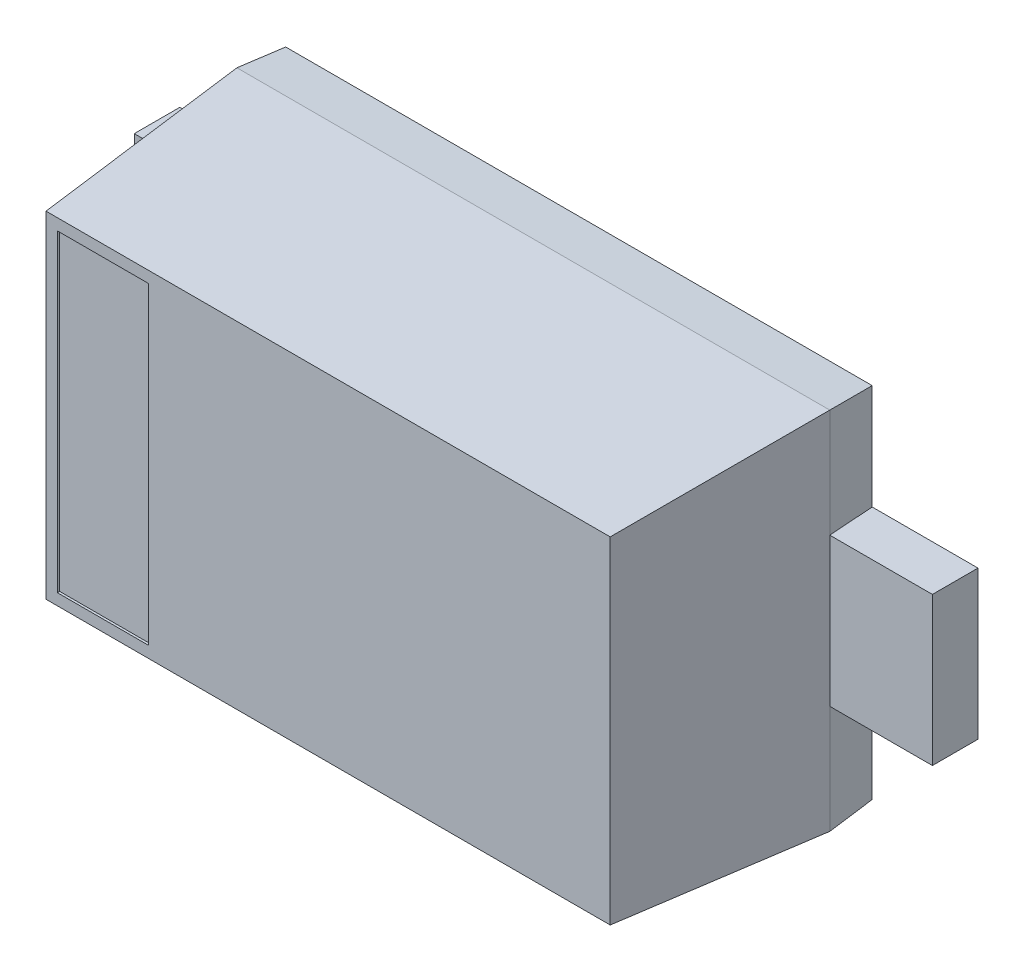
ISO-10303-21;
HEADER;
FILE_DESCRIPTION(('STEP AP214'),'2;1');
FILE_NAME('part.step','',(''),(''),'','','');
FILE_SCHEMA(('AUTOMOTIVE_DESIGN { 1 0 10303 214 1 1 1 1 }'));
ENDSEC;
DATA;
#1=APPLICATION_CONTEXT('core data for automotive mechanical design processes');
#2=APPLICATION_PROTOCOL_DEFINITION('international standard','automotive_design',2000,#1);
#3=PRODUCT_CONTEXT('',#1,'mechanical');
#4=PRODUCT('Part','Part','',(#3));
#5=PRODUCT_RELATED_PRODUCT_CATEGORY('part','',(#4));
#6=PRODUCT_DEFINITION_FORMATION('','',#4);
#7=PRODUCT_DEFINITION_CONTEXT('part definition',#1,'design');
#8=PRODUCT_DEFINITION('design','',#6,#7);
#9=PRODUCT_DEFINITION_SHAPE('','',#8);
#10=(LENGTH_UNIT() NAMED_UNIT(*) SI_UNIT(.MILLI.,.METRE.));
#11=(NAMED_UNIT(*) PLANE_ANGLE_UNIT() SI_UNIT($,.RADIAN.));
#12=(NAMED_UNIT(*) SI_UNIT($,.STERADIAN.) SOLID_ANGLE_UNIT());
#13=UNCERTAINTY_MEASURE_WITH_UNIT(LENGTH_MEASURE(1.E-05),#10,'distance_accuracy_value','');
#14=(GEOMETRIC_REPRESENTATION_CONTEXT(3) GLOBAL_UNCERTAINTY_ASSIGNED_CONTEXT((#13)) GLOBAL_UNIT_ASSIGNED_CONTEXT((#10,
#11,#12)) REPRESENTATION_CONTEXT('',''));
#15=CARTESIAN_POINT('',(0.,0.,0.));
#16=DIRECTION('',(0.,0.,1.));
#17=DIRECTION('',(1.,0.,0.));
#18=AXIS2_PLACEMENT_3D('',#15,#16,#17);
#19=CARTESIAN_POINT('',(-1.187065869251,-0.687065869251,1.09));
#20=DIRECTION('',(0.,0.,1.));
#21=DIRECTION('',(1.,0.,0.));
#22=AXIS2_PLACEMENT_3D('',#19,#20,#21);
#23=PLANE('',#22);
#24=DIRECTION('',(0.,1.,0.));
#25=VECTOR('',#24,1.);
#26=CARTESIAN_POINT('',(-1.187065869251,-0.687065869251,1.09));
#27=LINE('',#26,#25);
#28=CARTESIAN_POINT('',(-1.187065869251,-0.687065869251,1.09));
#29=VERTEX_POINT('',#28);
#30=CARTESIAN_POINT('',(-1.187065869251,0.687065869251,1.09));
#31=VERTEX_POINT('',#30);
#32=EDGE_CURVE('E122',#29,#31,#27,.T.);
#33=ORIENTED_EDGE('',*,*,#32,.F.);
#34=DIRECTION('',(1.,0.,0.));
#35=VECTOR('',#34,1.);
#36=CARTESIAN_POINT('',(-1.187065869251,-0.687065869251,1.09));
#37=LINE('',#36,#35);
#38=CARTESIAN_POINT('',(-0.787065869251,-0.687065869251,1.09));
#39=VERTEX_POINT('',#38);
#40=EDGE_CURVE('E126',#29,#39,#37,.T.);
#41=ORIENTED_EDGE('',*,*,#40,.T.);
#42=DIRECTION('',(0.,1.,0.));
#43=VECTOR('',#42,1.);
#44=CARTESIAN_POINT('',(-0.787065869251,-0.687065869251,1.09));
#45=LINE('',#44,#43);
#46=CARTESIAN_POINT('',(-0.787065869251,0.687065869251,1.09));
#47=VERTEX_POINT('',#46);
#48=EDGE_CURVE('E151',#39,#47,#45,.T.);
#49=ORIENTED_EDGE('',*,*,#48,.T.);
#50=DIRECTION('',(1.,0.,0.));
#51=VECTOR('',#50,1.);
#52=CARTESIAN_POINT('',(-1.187065869251,0.687065869251,1.09));
#53=LINE('',#52,#51);
#54=EDGE_CURVE('E128',#31,#47,#53,.T.);
#55=ORIENTED_EDGE('',*,*,#54,.F.);
#56=EDGE_LOOP('',(#33,#41,#49,#55));
#57=FACE_BOUND('',#56,.T.);
#58=ADVANCED_FACE('F17',(#57),#23,.T.);
#59=CARTESIAN_POINT('',(-1.286014637611,0.325,0.2));
#60=DIRECTION('',(0.,0.,1.));
#61=DIRECTION('',(1.,0.,0.));
#62=AXIS2_PLACEMENT_3D('',#59,#60,#61);
#63=PLANE('',#62);
#64=DIRECTION('',(0.,-1.,0.));
#65=VECTOR('',#64,1.);
#66=CARTESIAN_POINT('',(-1.3,0.8,0.2));
#67=LINE('',#66,#65);
#68=CARTESIAN_POINT('',(-1.3,0.325,0.2));
#69=VERTEX_POINT('',#68);
#70=CARTESIAN_POINT('',(-1.3,-0.325,0.2));
#71=VERTEX_POINT('',#70);
#72=EDGE_CURVE('E312',#69,#71,#67,.T.);
#73=ORIENTED_EDGE('',*,*,#72,.F.);
#74=DIRECTION('',(-1.,0.,0.));
#75=VECTOR('',#74,1.);
#76=CARTESIAN_POINT('',(-1.286014637611,0.325,0.2));
#77=LINE('',#76,#75);
#78=CARTESIAN_POINT('',(-1.75,0.325,0.2));
#79=VERTEX_POINT('',#78);
#80=EDGE_CURVE('E27',#69,#79,#77,.T.);
#81=ORIENTED_EDGE('',*,*,#80,.T.);
#82=DIRECTION('',(0.,-1.,0.));
#83=VECTOR('',#82,1.);
#84=CARTESIAN_POINT('',(-1.75,0.325,0.2));
#85=LINE('',#84,#83);
#86=CARTESIAN_POINT('',(-1.75,-0.325,0.2));
#87=VERTEX_POINT('',#86);
#88=EDGE_CURVE('E11',#79,#87,#85,.T.);
#89=ORIENTED_EDGE('',*,*,#88,.T.);
#90=DIRECTION('',(-1.,0.,0.));
#91=VECTOR('',#90,1.);
#92=CARTESIAN_POINT('',(-1.286014637611,-0.325,0.2));
#93=LINE('',#92,#91);
#94=EDGE_CURVE('E157',#71,#87,#93,.T.);
#95=ORIENTED_EDGE('',*,*,#94,.F.);
#96=EDGE_LOOP('',(#73,#81,#89,#95));
#97=FACE_BOUND('',#96,.T.);
#98=ADVANCED_FACE('F489',(#97),#63,.T.);
#99=CARTESIAN_POINT('',(-1.75,0.325,0.));
#100=DIRECTION('',(-1.,0.,0.));
#101=DIRECTION('',(0.,0.,1.));
#102=AXIS2_PLACEMENT_3D('',#99,#100,#101);
#103=PLANE('',#102);
#104=DIRECTION('',(0.,0.,1.));
#105=VECTOR('',#104,1.);
#106=CARTESIAN_POINT('',(-1.75,0.325,0.));
#107=LINE('',#106,#105);
#108=CARTESIAN_POINT('',(-1.75,0.325,0.));
#109=VERTEX_POINT('',#108);
#110=EDGE_CURVE('E166',#109,#79,#107,.T.);
#111=ORIENTED_EDGE('',*,*,#110,.F.);
#112=DIRECTION('',(0.,-1.,0.));
#113=VECTOR('',#112,1.);
#114=CARTESIAN_POINT('',(-1.75,0.325,0.));
#115=LINE('',#114,#113);
#116=CARTESIAN_POINT('',(-1.75,-0.325,0.));
#117=VERTEX_POINT('',#116);
#118=EDGE_CURVE('E266',#109,#117,#115,.T.);
#119=ORIENTED_EDGE('',*,*,#118,.T.);
#120=DIRECTION('',(0.,0.,1.));
#121=VECTOR('',#120,1.);
#122=CARTESIAN_POINT('',(-1.75,-0.325,0.));
#123=LINE('',#122,#121);
#124=EDGE_CURVE('E161',#117,#87,#123,.T.);
#125=ORIENTED_EDGE('',*,*,#124,.T.);
#126=ORIENTED_EDGE('',*,*,#88,.F.);
#127=EDGE_LOOP('',(#111,#119,#125,#126));
#128=FACE_BOUND('',#127,.T.);
#129=ADVANCED_FACE('F327',(#128),#103,.T.);
#130=CARTESIAN_POINT('',(-1.286014637611,0.325,0.));
#131=DIRECTION('',(0.,-1.,0.));
#132=DIRECTION('',(-1.,0.,0.));
#133=AXIS2_PLACEMENT_3D('',#130,#131,#132);
#134=PLANE('',#133);
#135=ORIENTED_EDGE('',*,*,#110,.T.);
#136=ORIENTED_EDGE('',*,*,#80,.F.);
#137=DIRECTION('',(-0.0697564737430673,0.,0.997564050259898));
#138=VECTOR('',#137,1.);
#139=CARTESIAN_POINT('',(-1.29300731708794,0.325,0.0999999754379));
#140=LINE('',#139,#138);
#141=CARTESIAN_POINT('',(-1.286014637611,0.325,0.));
#142=VERTEX_POINT('',#141);
#143=EDGE_CURVE('E169',#142,#69,#140,.T.);
#144=ORIENTED_EDGE('',*,*,#143,.F.);
#145=DIRECTION('',(-1.,0.,0.));
#146=VECTOR('',#145,1.);
#147=CARTESIAN_POINT('',(-1.286014637611,0.325,0.));
#148=LINE('',#147,#146);
#149=EDGE_CURVE('E174',#142,#109,#148,.T.);
#150=ORIENTED_EDGE('',*,*,#149,.T.);
#151=EDGE_LOOP('',(#135,#136,#144,#150));
#152=FACE_BOUND('',#151,.T.);
#153=ADVANCED_FACE('F322',(#152),#134,.F.);
#154=CARTESIAN_POINT('',(-1.286014637611,-0.325,0.));
#155=DIRECTION('',(0.,-1.,0.));
#156=DIRECTION('',(-1.,0.,0.));
#157=AXIS2_PLACEMENT_3D('',#154,#155,#156);
#158=PLANE('',#157);
#159=DIRECTION('',(-1.,0.,0.));
#160=VECTOR('',#159,1.);
#161=CARTESIAN_POINT('',(-1.286014637611,-0.325,0.));
#162=LINE('',#161,#160);
#163=CARTESIAN_POINT('',(-1.286014637611,-0.325,0.));
#164=VERTEX_POINT('',#163);
#165=EDGE_CURVE('E305',#164,#117,#162,.T.);
#166=ORIENTED_EDGE('',*,*,#165,.F.);
#167=DIRECTION('',(-0.0697564737430673,0.,0.997564050259898));
#168=VECTOR('',#167,1.);
#169=CARTESIAN_POINT('',(-1.29300731708794,-0.325,0.0999999754379));
#170=LINE('',#169,#168);
#171=EDGE_CURVE('E175',#164,#71,#170,.T.);
#172=ORIENTED_EDGE('',*,*,#171,.T.);
#173=ORIENTED_EDGE('',*,*,#94,.T.);
#174=ORIENTED_EDGE('',*,*,#124,.F.);
#175=EDGE_LOOP('',(#166,#172,#173,#174));
#176=FACE_BOUND('',#175,.T.);
#177=ADVANCED_FACE('F334',(#176),#158,.T.);
#178=CARTESIAN_POINT('',(-1.187065869251,0.687065869251,1.09));
#179=DIRECTION('',(0.,1.,0.));
#180=DIRECTION('',(1.,0.,0.));
#181=AXIS2_PLACEMENT_3D('',#178,#179,#180);
#182=PLANE('',#181);
#183=DIRECTION('',(1.,0.,0.));
#184=VECTOR('',#183,1.);
#185=CARTESIAN_POINT('',(-1.212065869251,0.687065869251,1.1));
#186=LINE('',#185,#184);
#187=CARTESIAN_POINT('',(-1.187065869251,0.687065869251,1.1));
#188=VERTEX_POINT('',#187);
#189=CARTESIAN_POINT('',(-0.787065869251,0.687065869251,1.1));
#190=VERTEX_POINT('',#189);
#191=EDGE_CURVE('E252',#188,#190,#186,.T.);
#192=ORIENTED_EDGE('',*,*,#191,.F.);
#193=DIRECTION('',(0.,0.,1.));
#194=VECTOR('',#193,1.);
#195=CARTESIAN_POINT('',(-1.187065869251,0.687065869251,1.09));
#196=LINE('',#195,#194);
#197=EDGE_CURVE('E132',#31,#188,#196,.T.);
#198=ORIENTED_EDGE('',*,*,#197,.F.);
#199=ORIENTED_EDGE('',*,*,#54,.T.);
#200=DIRECTION('',(0.,0.,1.));
#201=VECTOR('',#200,1.);
#202=CARTESIAN_POINT('',(-0.787065869251,0.687065869251,1.09));
#203=LINE('',#202,#201);
#204=EDGE_CURVE('E316',#47,#190,#203,.T.);
#205=ORIENTED_EDGE('',*,*,#204,.T.);
#206=EDGE_LOOP('',(#192,#198,#199,#205));
#207=FACE_BOUND('',#206,.T.);
#208=ADVANCED_FACE('F426',(#207),#182,.F.);
#209=CARTESIAN_POINT('',(-1.187065869251,-0.687065869251,1.09));
#210=DIRECTION('',(1.,0.,0.));
#211=DIRECTION('',(0.,1.,0.));
#212=AXIS2_PLACEMENT_3D('',#209,#210,#211);
#213=PLANE('',#212);
#214=DIRECTION('',(0.,0.,1.));
#215=VECTOR('',#214,1.);
#216=CARTESIAN_POINT('',(-1.187065869251,-0.687065869251,1.09));
#217=LINE('',#216,#215);
#218=CARTESIAN_POINT('',(-1.187065869251,-0.687065869251,1.1));
#219=VERTEX_POINT('',#218);
#220=EDGE_CURVE('E133',#29,#219,#217,.T.);
#221=ORIENTED_EDGE('',*,*,#220,.F.);
#222=ORIENTED_EDGE('',*,*,#32,.T.);
#223=ORIENTED_EDGE('',*,*,#197,.T.);
#224=DIRECTION('',(0.,-1.,0.));
#225=VECTOR('',#224,1.);
#226=CARTESIAN_POINT('',(-1.187065869251,-0.712065869251,1.1));
#227=LINE('',#226,#225);
#228=EDGE_CURVE('E138',#188,#219,#227,.T.);
#229=ORIENTED_EDGE('',*,*,#228,.T.);
#230=EDGE_LOOP('',(#221,#222,#223,#229));
#231=FACE_BOUND('',#230,.T.);
#232=ADVANCED_FACE('F136',(#231),#213,.T.);
#233=CARTESIAN_POINT('',(-1.187065869251,-0.687065869251,1.09));
#234=DIRECTION('',(0.,1.,0.));
#235=DIRECTION('',(1.,0.,0.));
#236=AXIS2_PLACEMENT_3D('',#233,#234,#235);
#237=PLANE('',#236);
#238=DIRECTION('',(0.,0.,1.));
#239=VECTOR('',#238,1.);
#240=CARTESIAN_POINT('',(-0.787065869251,-0.687065869251,1.09));
#241=LINE('',#240,#239);
#242=CARTESIAN_POINT('',(-0.787065869251,-0.687065869251,1.1));
#243=VERTEX_POINT('',#242);
#244=EDGE_CURVE('E145',#39,#243,#241,.T.);
#245=ORIENTED_EDGE('',*,*,#244,.F.);
#246=ORIENTED_EDGE('',*,*,#40,.F.);
#247=ORIENTED_EDGE('',*,*,#220,.T.);
#248=DIRECTION('',(1.,0.,0.));
#249=VECTOR('',#248,1.);
#250=CARTESIAN_POINT('',(-1.212065869251,-0.687065869251,1.1));
#251=LINE('',#250,#249);
#252=EDGE_CURVE('E300',#219,#243,#251,.T.);
#253=ORIENTED_EDGE('',*,*,#252,.T.);
#254=EDGE_LOOP('',(#245,#246,#247,#253));
#255=FACE_BOUND('',#254,.T.);
#256=ADVANCED_FACE('F144',(#255),#237,.T.);
#257=CARTESIAN_POINT('',(-0.787065869251,-0.687065869251,1.09));
#258=DIRECTION('',(1.,0.,0.));
#259=DIRECTION('',(0.,1.,0.));
#260=AXIS2_PLACEMENT_3D('',#257,#258,#259);
#261=PLANE('',#260);
#262=DIRECTION('',(0.,-1.,0.));
#263=VECTOR('',#262,1.);
#264=CARTESIAN_POINT('',(-0.787065869251,-0.712065869251,1.1));
#265=LINE('',#264,#263);
#266=EDGE_CURVE('E249',#190,#243,#265,.T.);
#267=ORIENTED_EDGE('',*,*,#266,.F.);
#268=ORIENTED_EDGE('',*,*,#204,.F.);
#269=ORIENTED_EDGE('',*,*,#48,.F.);
#270=ORIENTED_EDGE('',*,*,#244,.T.);
#271=EDGE_LOOP('',(#267,#268,#269,#270));
#272=FACE_BOUND('',#271,.T.);
#273=ADVANCED_FACE('F423',(#272),#261,.F.);
#274=CARTESIAN_POINT('',(-1.3,0.8,0.2));
#275=DIRECTION('',(-0.997564050259837,0.,0.0697564737439494));
#276=DIRECTION('',(0.,-1.,0.));
#277=AXIS2_PLACEMENT_3D('',#274,#275,#276);
#278=PLANE('',#277);
#279=DIRECTION('',(0.,-1.,0.));
#280=VECTOR('',#279,1.);
#281=CARTESIAN_POINT('',(-1.3,0.8,0.2));
#282=LINE('',#281,#280);
#283=CARTESIAN_POINT('',(-1.3,0.8,0.2));
#284=VERTEX_POINT('',#283);
#285=EDGE_CURVE('E173',#284,#69,#282,.T.);
#286=ORIENTED_EDGE('',*,*,#285,.T.);
#287=ORIENTED_EDGE('',*,*,#72,.T.);
#288=DIRECTION('',(0.,-1.,0.));
#289=VECTOR('',#288,1.);
#290=CARTESIAN_POINT('',(-1.3,0.8,0.2));
#291=LINE('',#290,#289);
#292=CARTESIAN_POINT('',(-1.3,-0.8,0.2));
#293=VERTEX_POINT('',#292);
#294=EDGE_CURVE('E179',#71,#293,#291,.T.);
#295=ORIENTED_EDGE('',*,*,#294,.T.);
#296=DIRECTION('',(0.06958737431649,0.0695873743164903,0.995145815783533));
#297=VECTOR('',#296,1.);
#298=CARTESIAN_POINT('',(-1.2685329346255,-0.7685329346255,0.65));
#299=LINE('',#298,#297);
#300=CARTESIAN_POINT('',(-1.237065869251,-0.737065869251,1.1));
#301=VERTEX_POINT('',#300);
#302=EDGE_CURVE('E189',#293,#301,#299,.T.);
#303=ORIENTED_EDGE('',*,*,#302,.T.);
#304=DIRECTION('',(0.,-1.,0.));
#305=VECTOR('',#304,1.);
#306=CARTESIAN_POINT('',(-1.237065869251,0.737065869251,1.1));
#307=LINE('',#306,#305);
#308=CARTESIAN_POINT('',(-1.237065869251,0.737065869251,1.1));
#309=VERTEX_POINT('',#308);
#310=EDGE_CURVE('E297',#309,#301,#307,.T.);
#311=ORIENTED_EDGE('',*,*,#310,.F.);
#312=DIRECTION('',(0.06958737431649,-0.0695873743164903,0.995145815783533));
#313=VECTOR('',#312,1.);
#314=CARTESIAN_POINT('',(-1.2685329346255,0.7685329346255,0.65));
#315=LINE('',#314,#313);
#316=EDGE_CURVE('E184',#284,#309,#315,.T.);
#317=ORIENTED_EDGE('',*,*,#316,.F.);
#318=EDGE_LOOP('',(#286,#287,#295,#303,#311,#317));
#319=FACE_BOUND('',#318,.T.);
#320=ADVANCED_FACE('F342',(#319),#278,.T.);
#321=CARTESIAN_POINT('',(-1.286014637611,0.786014637611,0.));
#322=DIRECTION('',(-0.997564050259721,0.,-0.0697564737456034));
#323=DIRECTION('',(0.,-1.,0.));
#324=AXIS2_PLACEMENT_3D('',#321,#322,#323);
#325=PLANE('',#324);
#326=DIRECTION('',(-0.0695873743181321,0.0695873743181331,0.995145815783303));
#327=VECTOR('',#326,1.);
#328=CARTESIAN_POINT('',(-1.2930073188055,0.7930073188055,0.1));
#329=LINE('',#328,#327);
#330=CARTESIAN_POINT('',(-1.286014637611,0.786014637611,0.));
#331=VERTEX_POINT('',#330);
#332=EDGE_CURVE('E180',#331,#284,#329,.T.);
#333=ORIENTED_EDGE('',*,*,#332,.F.);
#334=DIRECTION('',(0.,-1.,0.));
#335=VECTOR('',#334,1.);
#336=CARTESIAN_POINT('',(-1.286014637611,0.786014637611,0.));
#337=LINE('',#336,#335);
#338=EDGE_CURVE('E283',#331,#142,#337,.T.);
#339=ORIENTED_EDGE('',*,*,#338,.T.);
#340=ORIENTED_EDGE('',*,*,#143,.T.);
#341=ORIENTED_EDGE('',*,*,#285,.F.);
#342=EDGE_LOOP('',(#333,#339,#340,#341));
#343=FACE_BOUND('',#342,.T.);
#344=ADVANCED_FACE('F452',(#343),#325,.T.);
#345=CARTESIAN_POINT('',(-1.286014637611,0.786014637611,0.));
#346=DIRECTION('',(-0.997564050259721,0.,-0.0697564737456034));
#347=DIRECTION('',(0.,-1.,0.));
#348=AXIS2_PLACEMENT_3D('',#345,#346,#347);
#349=PLANE('',#348);
#350=ORIENTED_EDGE('',*,*,#171,.F.);
#351=DIRECTION('',(0.,-1.,0.));
#352=VECTOR('',#351,1.);
#353=CARTESIAN_POINT('',(-1.286014637611,0.786014637611,0.));
#354=LINE('',#353,#352);
#355=CARTESIAN_POINT('',(-1.286014637611,-0.786014637611,0.));
#356=VERTEX_POINT('',#355);
#357=EDGE_CURVE('E276',#164,#356,#354,.T.);
#358=ORIENTED_EDGE('',*,*,#357,.T.);
#359=DIRECTION('',(-0.0695873743181321,-0.0695873743181331,0.995145815783303));
#360=VECTOR('',#359,1.);
#361=CARTESIAN_POINT('',(-1.2930073188055,-0.7930073188055,0.1));
#362=LINE('',#361,#360);
#363=EDGE_CURVE('E195',#356,#293,#362,.T.);
#364=ORIENTED_EDGE('',*,*,#363,.T.);
#365=ORIENTED_EDGE('',*,*,#294,.F.);
#366=EDGE_LOOP('',(#350,#358,#364,#365));
#367=FACE_BOUND('',#366,.T.);
#368=ADVANCED_FACE('F337',(#367),#349,.T.);
#369=CARTESIAN_POINT('',(1.286014637611,0.786014637611,0.));
#370=DIRECTION('',(0.,0.997564050259721,-0.0697564737456045));
#371=DIRECTION('',(-1.,0.,0.));
#372=AXIS2_PLACEMENT_3D('',#369,#370,#371);
#373=PLANE('',#372);
#374=DIRECTION('',(-1.,0.,0.));
#375=VECTOR('',#374,1.);
#376=CARTESIAN_POINT('',(1.286014637611,0.786014637611,0.));
#377=LINE('',#376,#375);
#378=CARTESIAN_POINT('',(1.286014637611,0.786014637611,0.));
#379=VERTEX_POINT('',#378);
#380=EDGE_CURVE('E287',#379,#331,#377,.T.);
#381=ORIENTED_EDGE('',*,*,#380,.T.);
#382=ORIENTED_EDGE('',*,*,#332,.T.);
#383=DIRECTION('',(-1.,0.,0.));
#384=VECTOR('',#383,1.);
#385=CARTESIAN_POINT('',(1.3,0.8,0.2));
#386=LINE('',#385,#384);
#387=CARTESIAN_POINT('',(1.3,0.8,0.2));
#388=VERTEX_POINT('',#387);
#389=EDGE_CURVE('E188',#388,#284,#386,.T.);
#390=ORIENTED_EDGE('',*,*,#389,.F.);
#391=DIRECTION('',(0.0695873743181321,0.0695873743181331,0.995145815783303));
#392=VECTOR('',#391,1.);
#393=CARTESIAN_POINT('',(1.2930073188055,0.7930073188055,0.1));
#394=LINE('',#393,#392);
#395=EDGE_CURVE('E200',#379,#388,#394,.T.);
#396=ORIENTED_EDGE('',*,*,#395,.F.);
#397=EDGE_LOOP('',(#381,#382,#390,#396));
#398=FACE_BOUND('',#397,.T.);
#399=ADVANCED_FACE('F446',(#398),#373,.T.);
#400=CARTESIAN_POINT('',(1.3,0.8,0.2));
#401=DIRECTION('',(0.,0.997564050259837,0.0697564737439496));
#402=DIRECTION('',(-1.,0.,0.));
#403=AXIS2_PLACEMENT_3D('',#400,#401,#402);
#404=PLANE('',#403);
#405=ORIENTED_EDGE('',*,*,#389,.T.);
#406=ORIENTED_EDGE('',*,*,#316,.T.);
#407=DIRECTION('',(-1.,0.,0.));
#408=VECTOR('',#407,1.);
#409=CARTESIAN_POINT('',(1.237065869251,0.737065869251,1.1));
#410=LINE('',#409,#408);
#411=CARTESIAN_POINT('',(1.237065869251,0.737065869251,1.1));
#412=VERTEX_POINT('',#411);
#413=EDGE_CURVE('E193',#412,#309,#410,.T.);
#414=ORIENTED_EDGE('',*,*,#413,.F.);
#415=DIRECTION('',(-0.06958737431649,-0.0695873743164903,0.995145815783533));
#416=VECTOR('',#415,1.);
#417=CARTESIAN_POINT('',(1.2685329346255,0.7685329346255,0.65));
#418=LINE('',#417,#416);
#419=EDGE_CURVE('E211',#388,#412,#418,.T.);
#420=ORIENTED_EDGE('',*,*,#419,.F.);
#421=EDGE_LOOP('',(#405,#406,#414,#420));
#422=FACE_BOUND('',#421,.T.);
#423=ADVANCED_FACE('F442',(#422),#404,.T.);
#424=CARTESIAN_POINT('',(-1.237065869251,-0.737065869251,1.1));
#425=DIRECTION('',(0.,0.,-1.));
#426=DIRECTION('',(0.,-1.,0.));
#427=AXIS2_PLACEMENT_3D('',#424,#425,#426);
#428=PLANE('',#427);
#429=ORIENTED_EDGE('',*,*,#252,.F.);
#430=ORIENTED_EDGE('',*,*,#228,.F.);
#431=ORIENTED_EDGE('',*,*,#191,.T.);
#432=ORIENTED_EDGE('',*,*,#266,.T.);
#433=EDGE_LOOP('',(#429,#430,#431,#432));
#434=FACE_BOUND('',#433,.T.);
#435=DIRECTION('',(0.,1.,0.));
#436=VECTOR('',#435,1.);
#437=CARTESIAN_POINT('',(1.237065869251,-0.737065869251,1.1));
#438=LINE('',#437,#436);
#439=CARTESIAN_POINT('',(1.237065869251,-0.737065869251,1.1));
#440=VERTEX_POINT('',#439);
#441=EDGE_CURVE('E210',#440,#412,#438,.T.);
#442=ORIENTED_EDGE('',*,*,#441,.T.);
#443=ORIENTED_EDGE('',*,*,#413,.T.);
#444=ORIENTED_EDGE('',*,*,#310,.T.);
#445=DIRECTION('',(1.,0.,0.));
#446=VECTOR('',#445,1.);
#447=CARTESIAN_POINT('',(-1.237065869251,-0.737065869251,1.1));
#448=LINE('',#447,#446);
#449=EDGE_CURVE('E194',#301,#440,#448,.T.);
#450=ORIENTED_EDGE('',*,*,#449,.T.);
#451=EDGE_LOOP('',(#442,#443,#444,#450));
#452=FACE_BOUND('',#451,.T.);
#453=ADVANCED_FACE('F353',(#434,#452),#428,.F.);
#454=CARTESIAN_POINT('',(-1.3,-0.8,0.2));
#455=DIRECTION('',(0.,-0.997564050259837,0.0697564737439496));
#456=DIRECTION('',(1.,0.,0.));
#457=AXIS2_PLACEMENT_3D('',#454,#455,#456);
#458=PLANE('',#457);
#459=DIRECTION('',(1.,0.,0.));
#460=VECTOR('',#459,1.);
#461=CARTESIAN_POINT('',(-1.3,-0.8,0.2));
#462=LINE('',#461,#460);
#463=CARTESIAN_POINT('',(1.3,-0.8,0.2));
#464=VERTEX_POINT('',#463);
#465=EDGE_CURVE('E199',#293,#464,#462,.T.);
#466=ORIENTED_EDGE('',*,*,#465,.T.);
#467=DIRECTION('',(-0.06958737431649,0.0695873743164903,0.995145815783533));
#468=VECTOR('',#467,1.);
#469=CARTESIAN_POINT('',(1.2685329346255,-0.7685329346255,0.65));
#470=LINE('',#469,#468);
#471=EDGE_CURVE('E206',#464,#440,#470,.T.);
#472=ORIENTED_EDGE('',*,*,#471,.T.);
#473=ORIENTED_EDGE('',*,*,#449,.F.);
#474=ORIENTED_EDGE('',*,*,#302,.F.);
#475=EDGE_LOOP('',(#466,#472,#473,#474));
#476=FACE_BOUND('',#475,.T.);
#477=ADVANCED_FACE('F347',(#476),#458,.T.);
#478=CARTESIAN_POINT('',(-1.286014637611,-0.786014637611,0.));
#479=DIRECTION('',(0.,-0.997564050259721,-0.0697564737456045));
#480=DIRECTION('',(1.,0.,0.));
#481=AXIS2_PLACEMENT_3D('',#478,#479,#480);
#482=PLANE('',#481);
#483=DIRECTION('',(1.,0.,0.));
#484=VECTOR('',#483,1.);
#485=CARTESIAN_POINT('',(-1.286014637611,-0.786014637611,0.));
#486=LINE('',#485,#484);
#487=CARTESIAN_POINT('',(1.286014637611,-0.786014637611,0.));
#488=VERTEX_POINT('',#487);
#489=EDGE_CURVE('E204',#356,#488,#486,.T.);
#490=ORIENTED_EDGE('',*,*,#489,.T.);
#491=DIRECTION('',(0.0695873743181321,-0.0695873743181331,0.995145815783303));
#492=VECTOR('',#491,1.);
#493=CARTESIAN_POINT('',(1.2930073188055,-0.7930073188055,0.1));
#494=LINE('',#493,#492);
#495=EDGE_CURVE('E216',#488,#464,#494,.T.);
#496=ORIENTED_EDGE('',*,*,#495,.T.);
#497=ORIENTED_EDGE('',*,*,#465,.F.);
#498=ORIENTED_EDGE('',*,*,#363,.F.);
#499=EDGE_LOOP('',(#490,#496,#497,#498));
#500=FACE_BOUND('',#499,.T.);
#501=ADVANCED_FACE('F380',(#500),#482,.T.);
#502=CARTESIAN_POINT('',(1.286014637611,-0.786014637611,0.));
#503=DIRECTION('',(0.997564050259721,0.,-0.0697564737456034));
#504=DIRECTION('',(0.,1.,0.));
#505=AXIS2_PLACEMENT_3D('',#502,#503,#504);
#506=PLANE('',#505);
#507=DIRECTION('',(0.0697564737430673,0.,0.997564050259898));
#508=VECTOR('',#507,1.);
#509=CARTESIAN_POINT('',(1.29300731708794,0.325,0.0999999754379));
#510=LINE('',#509,#508);
#511=CARTESIAN_POINT('',(1.286014637611,0.325,0.));
#512=VERTEX_POINT('',#511);
#513=CARTESIAN_POINT('',(1.3,0.325,0.2));
#514=VERTEX_POINT('',#513);
#515=EDGE_CURVE('E220',#512,#514,#510,.T.);
#516=ORIENTED_EDGE('',*,*,#515,.F.);
#517=DIRECTION('',(0.,1.,0.));
#518=VECTOR('',#517,1.);
#519=CARTESIAN_POINT('',(1.286014637611,-0.786014637611,0.));
#520=LINE('',#519,#518);
#521=EDGE_CURVE('E205',#512,#379,#520,.T.);
#522=ORIENTED_EDGE('',*,*,#521,.T.);
#523=ORIENTED_EDGE('',*,*,#395,.T.);
#524=DIRECTION('',(0.,1.,0.));
#525=VECTOR('',#524,1.);
#526=CARTESIAN_POINT('',(1.3,-0.8,0.2));
#527=LINE('',#526,#525);
#528=EDGE_CURVE('E215',#514,#388,#527,.T.);
#529=ORIENTED_EDGE('',*,*,#528,.F.);
#530=EDGE_LOOP('',(#516,#522,#523,#529));
#531=FACE_BOUND('',#530,.T.);
#532=ADVANCED_FACE('F449',(#531),#506,.T.);
#533=CARTESIAN_POINT('',(1.3,-0.8,0.2));
#534=DIRECTION('',(0.997564050259837,0.,0.0697564737439494));
#535=DIRECTION('',(0.,1.,0.));
#536=AXIS2_PLACEMENT_3D('',#533,#534,#535);
#537=PLANE('',#536);
#538=DIRECTION('',(0.,1.,0.));
#539=VECTOR('',#538,1.);
#540=CARTESIAN_POINT('',(1.3,-0.8,0.2));
#541=LINE('',#540,#539);
#542=CARTESIAN_POINT('',(1.3,-0.325,0.2));
#543=VERTEX_POINT('',#542);
#544=EDGE_CURVE('E256',#464,#543,#541,.T.);
#545=ORIENTED_EDGE('',*,*,#544,.T.);
#546=DIRECTION('',(0.,1.,0.));
#547=VECTOR('',#546,1.);
#548=CARTESIAN_POINT('',(1.3,-0.8,0.2));
#549=LINE('',#548,#547);
#550=EDGE_CURVE('E244',#543,#514,#549,.T.);
#551=ORIENTED_EDGE('',*,*,#550,.T.);
#552=ORIENTED_EDGE('',*,*,#528,.T.);
#553=ORIENTED_EDGE('',*,*,#419,.T.);
#554=ORIENTED_EDGE('',*,*,#441,.F.);
#555=ORIENTED_EDGE('',*,*,#471,.F.);
#556=EDGE_LOOP('',(#545,#551,#552,#553,#554,#555));
#557=FACE_BOUND('',#556,.T.);
#558=ADVANCED_FACE('F512',(#557),#537,.T.);
#559=CARTESIAN_POINT('',(1.286014637611,-0.786014637611,0.));
#560=DIRECTION('',(0.997564050259721,0.,-0.0697564737456034));
#561=DIRECTION('',(0.,1.,0.));
#562=AXIS2_PLACEMENT_3D('',#559,#560,#561);
#563=PLANE('',#562);
#564=ORIENTED_EDGE('',*,*,#495,.F.);
#565=DIRECTION('',(0.,1.,0.));
#566=VECTOR('',#565,1.);
#567=CARTESIAN_POINT('',(1.286014637611,-0.786014637611,0.));
#568=LINE('',#567,#566);
#569=CARTESIAN_POINT('',(1.286014637611,-0.325,0.));
#570=VERTEX_POINT('',#569);
#571=EDGE_CURVE('E219',#488,#570,#568,.T.);
#572=ORIENTED_EDGE('',*,*,#571,.T.);
#573=DIRECTION('',(0.0697564737430673,0.,0.997564050259898));
#574=VECTOR('',#573,1.);
#575=CARTESIAN_POINT('',(1.29300731708794,-0.325,0.0999999754379));
#576=LINE('',#575,#574);
#577=EDGE_CURVE('E21',#570,#543,#576,.T.);
#578=ORIENTED_EDGE('',*,*,#577,.T.);
#579=ORIENTED_EDGE('',*,*,#544,.F.);
#580=EDGE_LOOP('',(#564,#572,#578,#579));
#581=FACE_BOUND('',#580,.T.);
#582=ADVANCED_FACE('F19',(#581),#563,.T.);
#583=CARTESIAN_POINT('',(1.286014637611,-0.325,0.));
#584=DIRECTION('',(0.,0.,1.));
#585=DIRECTION('',(1.,0.,0.));
#586=AXIS2_PLACEMENT_3D('',#583,#584,#585);
#587=PLANE('',#586);
#588=DIRECTION('',(1.,0.,0.));
#589=VECTOR('',#588,1.);
#590=CARTESIAN_POINT('',(1.286014637611,0.325,0.));
#591=LINE('',#590,#589);
#592=CARTESIAN_POINT('',(1.75,0.325,0.));
#593=VERTEX_POINT('',#592);
#594=EDGE_CURVE('E223',#512,#593,#591,.T.);
#595=ORIENTED_EDGE('',*,*,#594,.T.);
#596=DIRECTION('',(0.,1.,0.));
#597=VECTOR('',#596,1.);
#598=CARTESIAN_POINT('',(1.75,-0.325,0.));
#599=LINE('',#598,#597);
#600=CARTESIAN_POINT('',(1.75,-0.325,0.));
#601=VERTEX_POINT('',#600);
#602=EDGE_CURVE('E410',#601,#593,#599,.T.);
#603=ORIENTED_EDGE('',*,*,#602,.F.);
#604=DIRECTION('',(1.,0.,0.));
#605=VECTOR('',#604,1.);
#606=CARTESIAN_POINT('',(1.286014637611,-0.325,0.));
#607=LINE('',#606,#605);
#608=EDGE_CURVE('E403',#570,#601,#607,.T.);
#609=ORIENTED_EDGE('',*,*,#608,.F.);
#610=ORIENTED_EDGE('',*,*,#571,.F.);
#611=ORIENTED_EDGE('',*,*,#489,.F.);
#612=ORIENTED_EDGE('',*,*,#357,.F.);
#613=ORIENTED_EDGE('',*,*,#165,.T.);
#614=ORIENTED_EDGE('',*,*,#118,.F.);
#615=ORIENTED_EDGE('',*,*,#149,.F.);
#616=ORIENTED_EDGE('',*,*,#338,.F.);
#617=ORIENTED_EDGE('',*,*,#380,.F.);
#618=ORIENTED_EDGE('',*,*,#521,.F.);
#619=EDGE_LOOP('',(#595,#603,#609,#610,#611,#612,#613,#614,#615,#616,#617,#618));
#620=FACE_BOUND('',#619,.T.);
#621=ADVANCED_FACE('F330',(#620),#587,.F.);
#622=CARTESIAN_POINT('',(1.286014637611,0.325,0.));
#623=DIRECTION('',(0.,1.,0.));
#624=DIRECTION('',(1.,0.,0.));
#625=AXIS2_PLACEMENT_3D('',#622,#623,#624);
#626=PLANE('',#625);
#627=ORIENTED_EDGE('',*,*,#594,.F.);
#628=ORIENTED_EDGE('',*,*,#515,.T.);
#629=DIRECTION('',(1.,0.,0.));
#630=VECTOR('',#629,1.);
#631=CARTESIAN_POINT('',(1.286014637611,0.325,0.2));
#632=LINE('',#631,#630);
#633=CARTESIAN_POINT('',(1.75,0.325,0.2));
#634=VERTEX_POINT('',#633);
#635=EDGE_CURVE('E234',#514,#634,#632,.T.);
#636=ORIENTED_EDGE('',*,*,#635,.T.);
#637=DIRECTION('',(0.,0.,1.));
#638=VECTOR('',#637,1.);
#639=CARTESIAN_POINT('',(1.75,0.325,0.));
#640=LINE('',#639,#638);
#641=EDGE_CURVE('E404',#593,#634,#640,.T.);
#642=ORIENTED_EDGE('',*,*,#641,.F.);
#643=EDGE_LOOP('',(#627,#628,#636,#642));
#644=FACE_BOUND('',#643,.T.);
#645=ADVANCED_FACE('F528',(#644),#626,.T.);
#646=CARTESIAN_POINT('',(1.286014637611,-0.325,0.2));
#647=DIRECTION('',(0.,0.,1.));
#648=DIRECTION('',(1.,0.,0.));
#649=AXIS2_PLACEMENT_3D('',#646,#647,#648);
#650=PLANE('',#649);
#651=ORIENTED_EDGE('',*,*,#550,.F.);
#652=DIRECTION('',(1.,0.,0.));
#653=VECTOR('',#652,1.);
#654=CARTESIAN_POINT('',(1.286014637611,-0.325,0.2));
#655=LINE('',#654,#653);
#656=CARTESIAN_POINT('',(1.75,-0.325,0.2));
#657=VERTEX_POINT('',#656);
#658=EDGE_CURVE('E391',#543,#657,#655,.T.);
#659=ORIENTED_EDGE('',*,*,#658,.T.);
#660=DIRECTION('',(0.,1.,0.));
#661=VECTOR('',#660,1.);
#662=CARTESIAN_POINT('',(1.75,-0.325,0.2));
#663=LINE('',#662,#661);
#664=EDGE_CURVE('E388',#657,#634,#663,.T.);
#665=ORIENTED_EDGE('',*,*,#664,.T.);
#666=ORIENTED_EDGE('',*,*,#635,.F.);
#667=EDGE_LOOP('',(#651,#659,#665,#666));
#668=FACE_BOUND('',#667,.T.);
#669=ADVANCED_FACE('F486',(#668),#650,.T.);
#670=CARTESIAN_POINT('',(1.286014637611,-0.325,0.));
#671=DIRECTION('',(0.,1.,0.));
#672=DIRECTION('',(1.,0.,0.));
#673=AXIS2_PLACEMENT_3D('',#670,#671,#672);
#674=PLANE('',#673);
#675=DIRECTION('',(0.,0.,1.));
#676=VECTOR('',#675,1.);
#677=CARTESIAN_POINT('',(1.75,-0.325,0.));
#678=LINE('',#677,#676);
#679=EDGE_CURVE('E416',#601,#657,#678,.T.);
#680=ORIENTED_EDGE('',*,*,#679,.T.);
#681=ORIENTED_EDGE('',*,*,#658,.F.);
#682=ORIENTED_EDGE('',*,*,#577,.F.);
#683=ORIENTED_EDGE('',*,*,#608,.T.);
#684=EDGE_LOOP('',(#680,#681,#682,#683));
#685=FACE_BOUND('',#684,.T.);
#686=ADVANCED_FACE('F477',(#685),#674,.F.);
#687=CARTESIAN_POINT('',(1.75,-0.325,0.));
#688=DIRECTION('',(1.,0.,0.));
#689=DIRECTION('',(0.,-1.,0.));
#690=AXIS2_PLACEMENT_3D('',#687,#688,#689);
#691=PLANE('',#690);
#692=ORIENTED_EDGE('',*,*,#679,.F.);
#693=ORIENTED_EDGE('',*,*,#602,.T.);
#694=ORIENTED_EDGE('',*,*,#641,.T.);
#695=ORIENTED_EDGE('',*,*,#664,.F.);
#696=EDGE_LOOP('',(#692,#693,#694,#695));
#697=FACE_BOUND('',#696,.T.);
#698=ADVANCED_FACE('F479',(#697),#691,.T.);
#699=CLOSED_SHELL('',(#58,#98,#129,#153,#177,#208,#232,#256,#273,#320,#344,#368,#399,#423,#453,
#477,#501,#532,#558,#582,#621,#645,#669,#686,#698));
#700=MANIFOLD_SOLID_BREP('B1',#699);
#701=ADVANCED_BREP_SHAPE_REPRESENTATION('',(#18,#700),#14);
#702=SHAPE_DEFINITION_REPRESENTATION(#9,#701);
ENDSEC;
END-ISO-10303-21;
